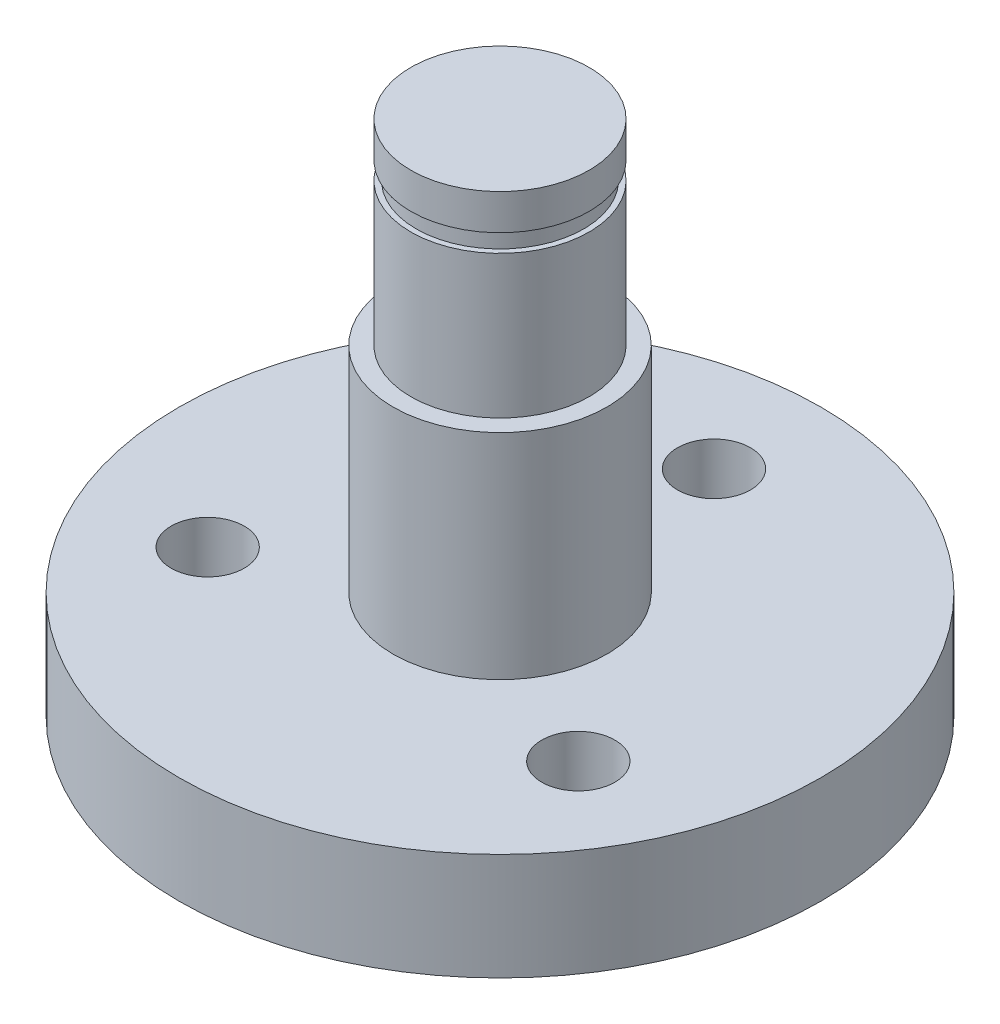
ISO-10303-21;
HEADER;
FILE_DESCRIPTION(('STEP AP214'),'2;1');
FILE_NAME('part.step','',(''),(''),'','','');
FILE_SCHEMA(('AUTOMOTIVE_DESIGN { 1 0 10303 214 1 1 1 1 }'));
ENDSEC;
DATA;
#1=APPLICATION_CONTEXT('core data for automotive mechanical design processes');
#2=APPLICATION_PROTOCOL_DEFINITION('international standard','automotive_design',2000,#1);
#3=PRODUCT_CONTEXT('',#1,'mechanical');
#4=PRODUCT('Part','Part','',(#3));
#5=PRODUCT_RELATED_PRODUCT_CATEGORY('part','',(#4));
#6=PRODUCT_DEFINITION_FORMATION('','',#4);
#7=PRODUCT_DEFINITION_CONTEXT('part definition',#1,'design');
#8=PRODUCT_DEFINITION('design','',#6,#7);
#9=PRODUCT_DEFINITION_SHAPE('','',#8);
#10=(LENGTH_UNIT() NAMED_UNIT(*) SI_UNIT(.MILLI.,.METRE.));
#11=(NAMED_UNIT(*) PLANE_ANGLE_UNIT() SI_UNIT($,.RADIAN.));
#12=(NAMED_UNIT(*) SI_UNIT($,.STERADIAN.) SOLID_ANGLE_UNIT());
#13=UNCERTAINTY_MEASURE_WITH_UNIT(LENGTH_MEASURE(1.E-05),#10,'distance_accuracy_value','');
#14=(GEOMETRIC_REPRESENTATION_CONTEXT(3) GLOBAL_UNCERTAINTY_ASSIGNED_CONTEXT((#13)) GLOBAL_UNIT_ASSIGNED_CONTEXT((#10,
#11,#12)) REPRESENTATION_CONTEXT('',''));
#15=CARTESIAN_POINT('',(0.,0.,0.));
#16=DIRECTION('',(0.,0.,1.));
#17=DIRECTION('',(1.,0.,0.));
#18=AXIS2_PLACEMENT_3D('',#15,#16,#17);
#19=CARTESIAN_POINT('',(0.,6.,0.));
#20=DIRECTION('',(0.,-1.,0.));
#21=DIRECTION('',(0.,0.,-1.));
#22=AXIS2_PLACEMENT_3D('',#19,#20,#21);
#23=CYLINDRICAL_SURFACE('',#22,3.);
#24=CARTESIAN_POINT('',(0.,6.,0.));
#25=DIRECTION('',(0.,1.,0.));
#26=DIRECTION('',(0.,0.,1.));
#27=AXIS2_PLACEMENT_3D('',#24,#25,#26);
#28=CIRCLE('',#27,3.);
#29=CARTESIAN_POINT('',(0.,6.,3.));
#30=VERTEX_POINT('',#29);
#31=EDGE_CURVE('E10',#30,#30,#28,.T.);
#32=ORIENTED_EDGE('',*,*,#31,.F.);
#33=EDGE_LOOP('',(#32));
#34=FACE_BOUND('',#33,.T.);
#35=CARTESIAN_POINT('',(0.,0.,0.));
#36=DIRECTION('',(0.,1.,0.));
#37=DIRECTION('',(0.,0.,1.));
#38=AXIS2_PLACEMENT_3D('',#35,#36,#37);
#39=CIRCLE('',#38,3.);
#40=CARTESIAN_POINT('',(0.,0.,3.));
#41=VERTEX_POINT('',#40);
#42=EDGE_CURVE('E50',#41,#41,#39,.T.);
#43=ORIENTED_EDGE('',*,*,#42,.T.);
#44=EDGE_LOOP('',(#43));
#45=FACE_BOUND('',#44,.T.);
#46=ADVANCED_FACE('F36',(#34,#45),#23,.T.);
#47=CARTESIAN_POINT('',(0.,6.,0.));
#48=DIRECTION('',(0.,1.,0.));
#49=DIRECTION('',(0.,0.,1.));
#50=AXIS2_PLACEMENT_3D('',#47,#48,#49);
#51=PLANE('',#50);
#52=CARTESIAN_POINT('',(0.,6.,0.));
#53=DIRECTION('',(0.,1.,0.));
#54=DIRECTION('',(0.,0.,1.));
#55=AXIS2_PLACEMENT_3D('',#52,#53,#54);
#56=CIRCLE('',#55,2.5);
#57=CARTESIAN_POINT('',(0.,6.,2.5));
#58=VERTEX_POINT('',#57);
#59=EDGE_CURVE('E42',#58,#58,#56,.T.);
#60=ORIENTED_EDGE('',*,*,#59,.F.);
#61=EDGE_LOOP('',(#60));
#62=FACE_BOUND('',#61,.T.);
#63=ORIENTED_EDGE('',*,*,#31,.T.);
#64=EDGE_LOOP('',(#63));
#65=FACE_BOUND('',#64,.T.);
#66=ADVANCED_FACE('F119',(#62,#65),#51,.T.);
#67=CARTESIAN_POINT('',(0.,11.5,0.));
#68=DIRECTION('',(0.,-1.,0.));
#69=DIRECTION('',(0.,0.,-1.));
#70=AXIS2_PLACEMENT_3D('',#67,#68,#69);
#71=CYLINDRICAL_SURFACE('',#70,2.5);
#72=CARTESIAN_POINT('',(0.,10.,0.));
#73=DIRECTION('',(0.,1.,0.));
#74=DIRECTION('',(0.,0.,1.));
#75=AXIS2_PLACEMENT_3D('',#72,#73,#74);
#76=CIRCLE('',#75,2.5);
#77=CARTESIAN_POINT('',(0.,10.,2.5));
#78=VERTEX_POINT('',#77);
#79=EDGE_CURVE('E64',#78,#78,#76,.T.);
#80=ORIENTED_EDGE('',*,*,#79,.F.);
#81=EDGE_LOOP('',(#80));
#82=FACE_BOUND('',#81,.T.);
#83=ORIENTED_EDGE('',*,*,#59,.T.);
#84=EDGE_LOOP('',(#83));
#85=FACE_BOUND('',#84,.T.);
#86=ADVANCED_FACE('F110',(#82,#85),#71,.T.);
#87=CARTESIAN_POINT('',(0.,-3.,0.));
#88=DIRECTION('',(0.,1.,0.));
#89=DIRECTION('',(0.,0.,1.));
#90=AXIS2_PLACEMENT_3D('',#87,#88,#89);
#91=CYLINDRICAL_SURFACE('',#90,9.);
#92=CARTESIAN_POINT('',(0.,-3.,0.));
#93=DIRECTION('',(0.,1.,0.));
#94=DIRECTION('',(0.,0.,1.));
#95=AXIS2_PLACEMENT_3D('',#92,#93,#94);
#96=CIRCLE('',#95,9.);
#97=CARTESIAN_POINT('',(0.,-3.,9.));
#98=VERTEX_POINT('',#97);
#99=EDGE_CURVE('E55',#98,#98,#96,.T.);
#100=ORIENTED_EDGE('',*,*,#99,.T.);
#101=EDGE_LOOP('',(#100));
#102=FACE_BOUND('',#101,.T.);
#103=CARTESIAN_POINT('',(0.,0.,0.));
#104=DIRECTION('',(0.,1.,0.));
#105=DIRECTION('',(0.,0.,1.));
#106=AXIS2_PLACEMENT_3D('',#103,#104,#105);
#107=CIRCLE('',#106,9.);
#108=CARTESIAN_POINT('',(0.,0.,9.));
#109=VERTEX_POINT('',#108);
#110=EDGE_CURVE('E56',#109,#109,#107,.T.);
#111=ORIENTED_EDGE('',*,*,#110,.F.);
#112=EDGE_LOOP('',(#111));
#113=FACE_BOUND('',#112,.T.);
#114=ADVANCED_FACE('F108',(#102,#113),#91,.T.);
#115=CARTESIAN_POINT('',(0.,-3.,0.));
#116=DIRECTION('',(0.,1.,0.));
#117=DIRECTION('',(0.,0.,1.));
#118=AXIS2_PLACEMENT_3D('',#115,#116,#117);
#119=PLANE('',#118);
#120=CARTESIAN_POINT('',(-5.19615242270629,-3.,2.99999999999972));
#121=DIRECTION('',(0.,1.,0.));
#122=DIRECTION('',(0.,0.,1.));
#123=AXIS2_PLACEMENT_3D('',#120,#121,#122);
#124=CIRCLE('',#123,1.025);
#125=CARTESIAN_POINT('',(-5.19615242270629,-3.,4.02499999999972));
#126=VERTEX_POINT('',#125);
#127=EDGE_CURVE('E85',#126,#126,#124,.T.);
#128=ORIENTED_EDGE('',*,*,#127,.T.);
#129=EDGE_LOOP('',(#128));
#130=FACE_BOUND('',#129,.T.);
#131=CARTESIAN_POINT('',(4.55964412348369E-13,-3.,-5.99999999999978));
#132=DIRECTION('',(0.,1.,0.));
#133=DIRECTION('',(0.,0.,1.));
#134=AXIS2_PLACEMENT_3D('',#131,#132,#133);
#135=CIRCLE('',#134,1.025);
#136=CARTESIAN_POINT('',(4.55964412348369E-13,-3.,-4.97499999999978));
#137=VERTEX_POINT('',#136);
#138=EDGE_CURVE('E79',#137,#137,#135,.T.);
#139=ORIENTED_EDGE('',*,*,#138,.T.);
#140=EDGE_LOOP('',(#139));
#141=FACE_BOUND('',#140,.T.);
#142=CARTESIAN_POINT('',(5.1961524227066,-3.,3.00000000000006));
#143=DIRECTION('',(0.,1.,0.));
#144=DIRECTION('',(0.,0.,1.));
#145=AXIS2_PLACEMENT_3D('',#142,#143,#144);
#146=CIRCLE('',#145,1.025);
#147=CARTESIAN_POINT('',(5.1961524227066,-3.,4.02500000000006));
#148=VERTEX_POINT('',#147);
#149=EDGE_CURVE('E73',#148,#148,#146,.T.);
#150=ORIENTED_EDGE('',*,*,#149,.T.);
#151=EDGE_LOOP('',(#150));
#152=FACE_BOUND('',#151,.T.);
#153=ORIENTED_EDGE('',*,*,#99,.F.);
#154=EDGE_LOOP('',(#153));
#155=FACE_BOUND('',#154,.T.);
#156=ADVANCED_FACE('F98',(#130,#141,#152,#155),#119,.F.);
#157=CARTESIAN_POINT('',(0.,0.,0.));
#158=DIRECTION('',(0.,1.,0.));
#159=DIRECTION('',(0.,0.,1.));
#160=AXIS2_PLACEMENT_3D('',#157,#158,#159);
#161=PLANE('',#160);
#162=CARTESIAN_POINT('',(-5.19615242270629,0.,2.99999999999972));
#163=DIRECTION('',(0.,1.,0.));
#164=DIRECTION('',(0.,0.,1.));
#165=AXIS2_PLACEMENT_3D('',#162,#163,#164);
#166=CIRCLE('',#165,1.025);
#167=CARTESIAN_POINT('',(-5.19615242270629,0.,4.02499999999972));
#168=VERTEX_POINT('',#167);
#169=EDGE_CURVE('E88',#168,#168,#166,.T.);
#170=ORIENTED_EDGE('',*,*,#169,.F.);
#171=EDGE_LOOP('',(#170));
#172=FACE_BOUND('',#171,.T.);
#173=CARTESIAN_POINT('',(4.55964412348369E-13,0.,-5.99999999999978));
#174=DIRECTION('',(0.,1.,0.));
#175=DIRECTION('',(0.,0.,1.));
#176=AXIS2_PLACEMENT_3D('',#173,#174,#175);
#177=CIRCLE('',#176,1.025);
#178=CARTESIAN_POINT('',(4.55964412348369E-13,0.,-4.97499999999978));
#179=VERTEX_POINT('',#178);
#180=EDGE_CURVE('E82',#179,#179,#177,.T.);
#181=ORIENTED_EDGE('',*,*,#180,.F.);
#182=EDGE_LOOP('',(#181));
#183=FACE_BOUND('',#182,.T.);
#184=CARTESIAN_POINT('',(5.1961524227066,0.,3.00000000000006));
#185=DIRECTION('',(0.,1.,0.));
#186=DIRECTION('',(0.,0.,1.));
#187=AXIS2_PLACEMENT_3D('',#184,#185,#186);
#188=CIRCLE('',#187,1.025);
#189=CARTESIAN_POINT('',(5.1961524227066,0.,4.02500000000006));
#190=VERTEX_POINT('',#189);
#191=EDGE_CURVE('E76',#190,#190,#188,.T.);
#192=ORIENTED_EDGE('',*,*,#191,.F.);
#193=EDGE_LOOP('',(#192));
#194=FACE_BOUND('',#193,.T.);
#195=ORIENTED_EDGE('',*,*,#42,.F.);
#196=EDGE_LOOP('',(#195));
#197=FACE_BOUND('',#196,.T.);
#198=ORIENTED_EDGE('',*,*,#110,.T.);
#199=EDGE_LOOP('',(#198));
#200=FACE_BOUND('',#199,.T.);
#201=ADVANCED_FACE('F94',(#172,#183,#194,#197,#200),#161,.T.);
#202=CARTESIAN_POINT('',(0.,10.5,2.35));
#203=DIRECTION('',(0.,1.,0.));
#204=DIRECTION('',(0.,0.,1.));
#205=AXIS2_PLACEMENT_3D('',#202,#203,#204);
#206=PLANE('',#205);
#207=CARTESIAN_POINT('',(0.,10.5,0.));
#208=DIRECTION('',(0.,1.,0.));
#209=DIRECTION('',(0.,0.,1.));
#210=AXIS2_PLACEMENT_3D('',#207,#208,#209);
#211=CIRCLE('',#210,2.5);
#212=CARTESIAN_POINT('',(0.,10.5,2.5));
#213=VERTEX_POINT('',#212);
#214=EDGE_CURVE('E59',#213,#213,#211,.T.);
#215=ORIENTED_EDGE('',*,*,#214,.F.);
#216=EDGE_LOOP('',(#215));
#217=FACE_BOUND('',#216,.T.);
#218=CARTESIAN_POINT('',(0.,10.5,0.));
#219=DIRECTION('',(0.,1.,0.));
#220=DIRECTION('',(0.,0.,1.));
#221=AXIS2_PLACEMENT_3D('',#218,#219,#220);
#222=CIRCLE('',#221,2.35);
#223=CARTESIAN_POINT('',(0.,10.5,2.35));
#224=VERTEX_POINT('',#223);
#225=EDGE_CURVE('E70',#224,#224,#222,.T.);
#226=ORIENTED_EDGE('',*,*,#225,.T.);
#227=EDGE_LOOP('',(#226));
#228=FACE_BOUND('',#227,.T.);
#229=ADVANCED_FACE('F97',(#217,#228),#206,.F.);
#230=CARTESIAN_POINT('',(0.,10.,2.5));
#231=DIRECTION('',(0.,-1.,0.));
#232=DIRECTION('',(0.,0.,-1.));
#233=AXIS2_PLACEMENT_3D('',#230,#231,#232);
#234=PLANE('',#233);
#235=CARTESIAN_POINT('',(0.,10.,0.));
#236=DIRECTION('',(0.,1.,0.));
#237=DIRECTION('',(0.,0.,1.));
#238=AXIS2_PLACEMENT_3D('',#235,#236,#237);
#239=CIRCLE('',#238,2.35);
#240=CARTESIAN_POINT('',(0.,10.,2.35));
#241=VERTEX_POINT('',#240);
#242=EDGE_CURVE('E67',#241,#241,#239,.T.);
#243=ORIENTED_EDGE('',*,*,#242,.F.);
#244=EDGE_LOOP('',(#243));
#245=FACE_BOUND('',#244,.T.);
#246=ORIENTED_EDGE('',*,*,#79,.T.);
#247=EDGE_LOOP('',(#246));
#248=FACE_BOUND('',#247,.T.);
#249=ADVANCED_FACE('F143',(#245,#248),#234,.F.);
#250=CARTESIAN_POINT('',(0.,9.,0.));
#251=DIRECTION('',(0.,1.,0.));
#252=DIRECTION('',(0.,0.,1.));
#253=AXIS2_PLACEMENT_3D('',#250,#251,#252);
#254=CYLINDRICAL_SURFACE('',#253,2.35);
#255=ORIENTED_EDGE('',*,*,#225,.F.);
#256=EDGE_LOOP('',(#255));
#257=FACE_BOUND('',#256,.T.);
#258=ORIENTED_EDGE('',*,*,#242,.T.);
#259=EDGE_LOOP('',(#258));
#260=FACE_BOUND('',#259,.T.);
#261=ADVANCED_FACE('F135',(#257,#260),#254,.T.);
#262=CARTESIAN_POINT('',(0.,11.5,0.));
#263=DIRECTION('',(0.,1.,0.));
#264=DIRECTION('',(0.,0.,1.));
#265=AXIS2_PLACEMENT_3D('',#262,#263,#264);
#266=PLANE('',#265);
#267=CARTESIAN_POINT('',(0.,11.5,0.));
#268=DIRECTION('',(0.,1.,0.));
#269=DIRECTION('',(0.,0.,1.));
#270=AXIS2_PLACEMENT_3D('',#267,#268,#269);
#271=CIRCLE('',#270,2.5);
#272=CARTESIAN_POINT('',(0.,11.5,2.5));
#273=VERTEX_POINT('',#272);
#274=EDGE_CURVE('E46',#273,#273,#271,.T.);
#275=ORIENTED_EDGE('',*,*,#274,.T.);
#276=EDGE_LOOP('',(#275));
#277=FACE_BOUND('',#276,.T.);
#278=ADVANCED_FACE('F133',(#277),#266,.T.);
#279=ORIENTED_EDGE('',*,*,#214,.T.);
#280=EDGE_LOOP('',(#279));
#281=FACE_BOUND('',#280,.T.);
#282=ORIENTED_EDGE('',*,*,#274,.F.);
#283=EDGE_LOOP('',(#282));
#284=FACE_BOUND('',#283,.T.);
#285=ADVANCED_FACE('F122',(#281,#284),#71,.T.);
#286=CARTESIAN_POINT('',(5.1961524227066,0.,3.00000000000006));
#287=DIRECTION('',(0.,1.,0.));
#288=DIRECTION('',(0.,0.,1.));
#289=AXIS2_PLACEMENT_3D('',#286,#287,#288);
#290=CYLINDRICAL_SURFACE('',#289,1.025);
#291=ORIENTED_EDGE('',*,*,#149,.F.);
#292=EDGE_LOOP('',(#291));
#293=FACE_BOUND('',#292,.T.);
#294=ORIENTED_EDGE('',*,*,#191,.T.);
#295=EDGE_LOOP('',(#294));
#296=FACE_BOUND('',#295,.T.);
#297=ADVANCED_FACE('F141',(#293,#296),#290,.F.);
#298=CARTESIAN_POINT('',(4.55964412348369E-13,0.,-5.99999999999978));
#299=DIRECTION('',(0.,1.,0.));
#300=DIRECTION('',(0.,0.,1.));
#301=AXIS2_PLACEMENT_3D('',#298,#299,#300);
#302=CYLINDRICAL_SURFACE('',#301,1.025);
#303=ORIENTED_EDGE('',*,*,#138,.F.);
#304=EDGE_LOOP('',(#303));
#305=FACE_BOUND('',#304,.T.);
#306=ORIENTED_EDGE('',*,*,#180,.T.);
#307=EDGE_LOOP('',(#306));
#308=FACE_BOUND('',#307,.T.);
#309=ADVANCED_FACE('F202',(#305,#308),#302,.F.);
#310=CARTESIAN_POINT('',(-5.19615242270629,0.,2.99999999999972));
#311=DIRECTION('',(0.,1.,0.));
#312=DIRECTION('',(0.,0.,1.));
#313=AXIS2_PLACEMENT_3D('',#310,#311,#312);
#314=CYLINDRICAL_SURFACE('',#313,1.025);
#315=ORIENTED_EDGE('',*,*,#127,.F.);
#316=EDGE_LOOP('',(#315));
#317=FACE_BOUND('',#316,.T.);
#318=ORIENTED_EDGE('',*,*,#169,.T.);
#319=EDGE_LOOP('',(#318));
#320=FACE_BOUND('',#319,.T.);
#321=ADVANCED_FACE('F92',(#317,#320),#314,.F.);
#322=CLOSED_SHELL('',(#46,#66,#86,#114,#156,#201,#229,#249,#261,#278,#285,#297,#309,#321));
#323=MANIFOLD_SOLID_BREP('B2',#322);
#324=ADVANCED_BREP_SHAPE_REPRESENTATION('',(#18,#323),#14);
#325=SHAPE_DEFINITION_REPRESENTATION(#9,#324);
ENDSEC;
END-ISO-10303-21;
